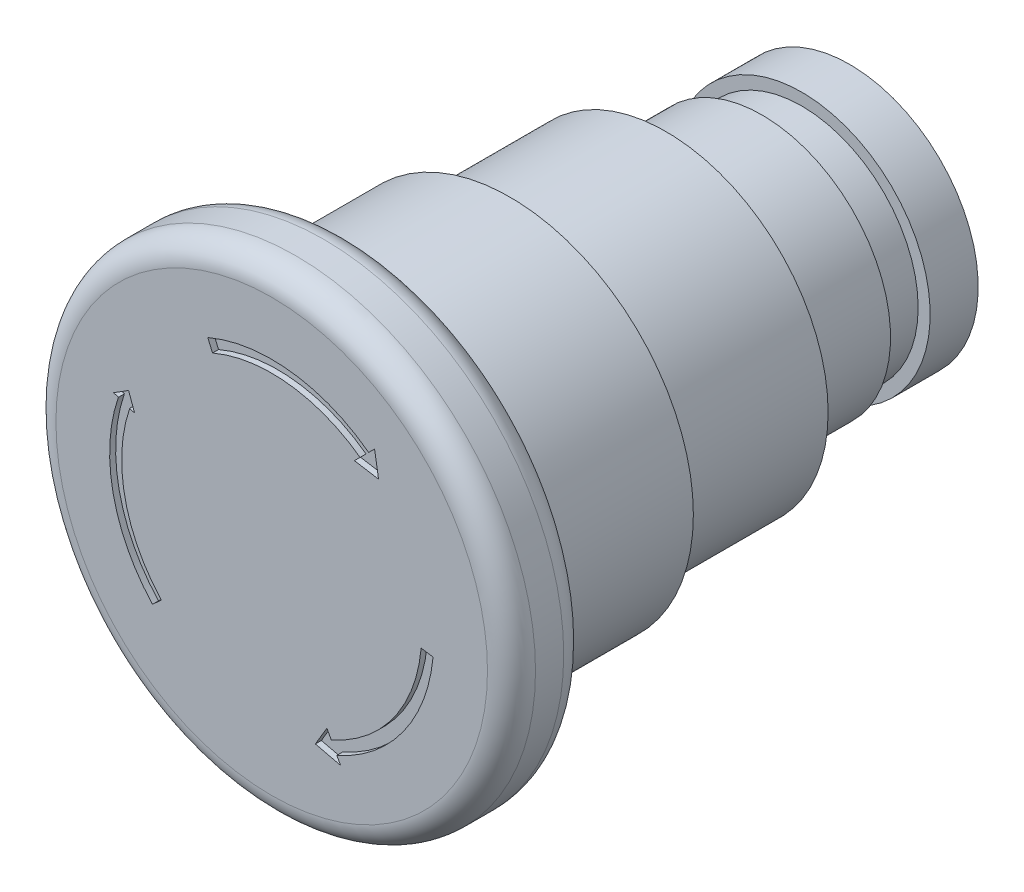
ISO-10303-21;
HEADER;
FILE_DESCRIPTION(('STEP AP214'),'2;1');
FILE_NAME('part.step','',(''),(''),'','','');
FILE_SCHEMA(('AUTOMOTIVE_DESIGN { 1 0 10303 214 1 1 1 1 }'));
ENDSEC;
DATA;
#1=APPLICATION_CONTEXT('core data for automotive mechanical design processes');
#2=APPLICATION_PROTOCOL_DEFINITION('international standard','automotive_design',2000,#1);
#3=PRODUCT_CONTEXT('',#1,'mechanical');
#4=PRODUCT('Part','Part','',(#3));
#5=PRODUCT_RELATED_PRODUCT_CATEGORY('part','',(#4));
#6=PRODUCT_DEFINITION_FORMATION('','',#4);
#7=PRODUCT_DEFINITION_CONTEXT('part definition',#1,'design');
#8=PRODUCT_DEFINITION('design','',#6,#7);
#9=PRODUCT_DEFINITION_SHAPE('','',#8);
#10=(LENGTH_UNIT() NAMED_UNIT(*) SI_UNIT(.MILLI.,.METRE.));
#11=(NAMED_UNIT(*) PLANE_ANGLE_UNIT() SI_UNIT($,.RADIAN.));
#12=(NAMED_UNIT(*) SI_UNIT($,.STERADIAN.) SOLID_ANGLE_UNIT());
#13=UNCERTAINTY_MEASURE_WITH_UNIT(LENGTH_MEASURE(1.E-05),#10,'distance_accuracy_value','');
#14=(GEOMETRIC_REPRESENTATION_CONTEXT(3) GLOBAL_UNCERTAINTY_ASSIGNED_CONTEXT((#13)) GLOBAL_UNIT_ASSIGNED_CONTEXT((#10,
#11,#12)) REPRESENTATION_CONTEXT('',''));
#15=CARTESIAN_POINT('',(0.,0.,0.));
#16=DIRECTION('',(0.,0.,1.));
#17=DIRECTION('',(1.,0.,0.));
#18=AXIS2_PLACEMENT_3D('',#15,#16,#17);
#19=CARTESIAN_POINT('',(0.,0.,6.35));
#20=DIRECTION('',(0.,0.,1.));
#21=DIRECTION('',(1.,0.,0.));
#22=AXIS2_PLACEMENT_3D('',#19,#20,#21);
#23=PLANE('',#22);
#24=DIRECTION('',(0.946159047702966,-0.3237021106663,0.));
#25=VECTOR('',#24,1.);
#26=CARTESIAN_POINT('',(-11.8269880962871,4.04627638332874,6.35));
#27=LINE('',#26,#25);
#28=CARTESIAN_POINT('',(-11.8269880962871,4.04627638332874,6.35));
#29=VERTEX_POINT('',#28);
#30=CARTESIAN_POINT('',(-11.4166932576351,3.90590536897385,6.35));
#31=VERTEX_POINT('',#30);
#32=EDGE_CURVE('E49',#29,#31,#27,.T.);
#33=ORIENTED_EDGE('',*,*,#32,.F.);
#34=CARTESIAN_POINT('',(0.,0.,6.35));
#35=DIRECTION('',(0.,0.,1.));
#36=DIRECTION('',(1.,0.,0.));
#37=AXIS2_PLACEMENT_3D('',#34,#35,#36);
#38=CIRCLE('',#37,12.5);
#39=CARTESIAN_POINT('',(-9.19520920877159,-8.46747468888584,6.35));
#40=VERTEX_POINT('',#39);
#41=EDGE_CURVE('E186',#29,#40,#38,.T.);
#42=ORIENTED_EDGE('',*,*,#41,.T.);
#43=DIRECTION('',(0.735616736701727,0.677397975110867,0.));
#44=VECTOR('',#43,1.);
#45=CARTESIAN_POINT('',(-9.93082594547331,-9.14487266399671,6.35));
#46=LINE('',#45,#44);
#47=CARTESIAN_POINT('',(-9.93082594547331,-9.14487266399671,6.35));
#48=VERTEX_POINT('',#47);
#49=EDGE_CURVE('E192',#48,#40,#46,.T.);
#50=ORIENTED_EDGE('',*,*,#49,.F.);
#51=CARTESIAN_POINT('',(0.,0.,6.35));
#52=DIRECTION('',(0.,0.,1.));
#53=DIRECTION('',(1.,0.,0.));
#54=AXIS2_PLACEMENT_3D('',#51,#52,#53);
#55=CIRCLE('',#54,13.5);
#56=CARTESIAN_POINT('',(-12.77314714399,4.36997849399504,6.35));
#57=VERTEX_POINT('',#56);
#58=EDGE_CURVE('E864',#57,#48,#55,.T.);
#59=ORIENTED_EDGE('',*,*,#58,.F.);
#60=DIRECTION('',(0.946159047702967,-0.323702110666296,0.));
#61=VECTOR('',#60,1.);
#62=CARTESIAN_POINT('',(-13.1680559862563,4.50508561586079,6.35));
#63=LINE('',#62,#61);
#64=CARTESIAN_POINT('',(-13.1680559862563,4.50508561586079,6.35));
#65=VERTEX_POINT('',#64);
#66=EDGE_CURVE('E863',#65,#57,#63,.T.);
#67=ORIENTED_EDGE('',*,*,#66,.F.);
#68=DIRECTION('',(-0.847110823370431,-0.531416270854281,0.));
#69=VECTOR('',#68,1.);
#70=CARTESIAN_POINT('',(-11.9225679380885,5.28641504253192,6.35));
#71=LINE('',#70,#69);
#72=CARTESIAN_POINT('',(-11.9225679380885,5.28641504253192,6.35));
#73=VERTEX_POINT('',#72);
#74=EDGE_CURVE('E203',#73,#65,#71,.T.);
#75=ORIENTED_EDGE('',*,*,#74,.F.);
#76=DIRECTION('',(-0.344067466332959,0.938944928422971,0.));
#77=VECTOR('',#76,1.);
#78=CARTESIAN_POINT('',(-11.4166932576351,3.90590536897385,6.35));
#79=LINE('',#78,#77);
#80=EDGE_CURVE('E198',#31,#73,#79,.T.);
#81=ORIENTED_EDGE('',*,*,#80,.F.);
#82=EDGE_LOOP('',(#33,#42,#50,#59,#67,#75,#81));
#83=FACE_BOUND('',#82,.T.);
#84=CARTESIAN_POINT('',(0.,0.,6.35));
#85=DIRECTION('',(0.,0.,1.));
#86=DIRECTION('',(1.,0.,0.));
#87=AXIS2_PLACEMENT_3D('',#84,#85,#86);
#88=CIRCLE('',#87,13.5);
#89=CARTESIAN_POINT('',(8.07680924443977,10.8173542249911,6.35));
#90=VERTEX_POINT('',#89);
#91=CARTESIAN_POINT('',(-5.32427616980022,12.4057278411102,6.35));
#92=VERTEX_POINT('',#91);
#93=EDGE_CURVE('E295',#90,#92,#88,.T.);
#94=ORIENTED_EDGE('',*,*,#93,.F.);
#95=DIRECTION('',(0.707106781186548,0.707106781186548,0.));
#96=VECTOR('',#95,1.);
#97=CARTESIAN_POINT('',(-1.37027249027566,1.37027249027566,6.35));
#98=LINE('',#97,#96);
#99=CARTESIAN_POINT('',(8.56914572080994,11.3096907013613,6.35));
#100=VERTEX_POINT('',#99);
#101=EDGE_CURVE('E258',#90,#100,#98,.T.);
#102=ORIENTED_EDGE('',*,*,#101,.T.);
#103=DIRECTION('',(-0.163195946532775,0.986593676766313,0.));
#104=VECTOR('',#103,1.);
#105=CARTESIAN_POINT('',(10.1618760605068,1.68091182955754,6.35));
#106=LINE('',#105,#104);
#107=CARTESIAN_POINT('',(8.90198472506287,9.29752763019587,6.35));
#108=VERTEX_POINT('',#107);
#109=EDGE_CURVE('E276',#108,#100,#106,.T.);
#110=ORIENTED_EDGE('',*,*,#109,.F.);
#111=DIRECTION('',(0.986593676766313,-0.163195946532772,0.));
#112=VECTOR('',#111,1.);
#113=CARTESIAN_POINT('',(1.73406297545167,10.4831988970488,6.35));
#114=LINE('',#113,#112);
#115=CARTESIAN_POINT('',(6.88982165389748,9.63036663444879,6.35));
#116=VERTEX_POINT('',#115);
#117=EDGE_CURVE('E307',#116,#108,#114,.T.);
#118=ORIENTED_EDGE('',*,*,#117,.F.);
#119=DIRECTION('',(0.707106781186546,0.707106781186549,0.));
#120=VECTOR('',#119,1.);
#121=CARTESIAN_POINT('',(-1.37027249027564,1.37027249027563,6.35));
#122=LINE('',#121,#120);
#123=CARTESIAN_POINT('',(7.36170055723163,10.1022455377829,6.35));
#124=VERTEX_POINT('',#123);
#125=EDGE_CURVE('E304',#116,#124,#122,.T.);
#126=ORIENTED_EDGE('',*,*,#125,.T.);
#127=CARTESIAN_POINT('',(0.,0.,6.35));
#128=DIRECTION('',(0.,0.,1.));
#129=DIRECTION('',(1.,0.,0.));
#130=AXIS2_PLACEMENT_3D('',#127,#128,#129);
#131=CIRCLE('',#130,12.5);
#132=CARTESIAN_POINT('',(-4.92988534240761,11.486785038065,6.35));
#133=VERTEX_POINT('',#132);
#134=EDGE_CURVE('E301',#124,#133,#131,.T.);
#135=ORIENTED_EDGE('',*,*,#134,.T.);
#136=DIRECTION('',(0.394390827392609,-0.918942803045202,0.));
#137=VECTOR('',#136,1.);
#138=CARTESIAN_POINT('',(0.,0.,6.35));
#139=LINE('',#138,#137);
#140=EDGE_CURVE('E298',#92,#133,#139,.T.);
#141=ORIENTED_EDGE('',*,*,#140,.F.);
#142=EDGE_LOOP('',(#94,#102,#110,#118,#126,#135,#141));
#143=FACE_BOUND('',#142,.T.);
#144=CARTESIAN_POINT('',(0.,0.,6.35));
#145=DIRECTION('',(0.,0.,1.));
#146=DIRECTION('',(1.,0.,0.));
#147=AXIS2_PLACEMENT_3D('',#144,#145,#146);
#148=CIRCLE('',#147,17.975);
#149=CARTESIAN_POINT('',(17.975,0.,6.35));
#150=VERTEX_POINT('',#149);
#151=EDGE_CURVE('E11',#150,#150,#148,.T.);
#152=ORIENTED_EDGE('',*,*,#151,.T.);
#153=EDGE_LOOP('',(#152));
#154=FACE_BOUND('',#153,.T.);
#155=CARTESIAN_POINT('',(0.,0.,6.35));
#156=DIRECTION('',(0.,0.,1.));
#157=DIRECTION('',(1.,0.,0.));
#158=AXIS2_PLACEMENT_3D('',#155,#156,#157);
#159=CIRCLE('',#158,13.5);
#160=CARTESIAN_POINT('',(5.42803448979416,-12.3606812748167,6.35));
#161=VERTEX_POINT('',#160);
#162=CARTESIAN_POINT('',(13.4409039520645,-1.2617848276852,6.35));
#163=VERTEX_POINT('',#162);
#164=EDGE_CURVE('E254',#161,#163,#159,.T.);
#165=ORIENTED_EDGE('',*,*,#164,.F.);
#166=DIRECTION('',(0.471282596185607,-0.881982264295918,0.));
#167=VECTOR('',#166,1.);
#168=CARTESIAN_POINT('',(-0.915448033372817,-0.489164854335662,6.35));
#169=LINE('',#168,#167);
#170=CARTESIAN_POINT('',(5.73317722565874,-12.931740938996,6.35));
#171=VERTEX_POINT('',#170);
#172=EDGE_CURVE('E57',#161,#171,#169,.T.);
#173=ORIENTED_EDGE('',*,*,#172,.T.);
#174=DIRECTION('',(-0.97275686117343,0.231827714132753,0.));
#175=VECTOR('',#174,1.);
#176=CARTESIAN_POINT('',(-2.608138369295,-10.943836042694,6.35));
#177=LINE('',#176,#175);
#178=CARTESIAN_POINT('',(3.63822210471963,-12.432470590687,6.35));
#179=VERTEX_POINT('',#178);
#180=EDGE_CURVE('E238',#171,#179,#177,.T.);
#181=ORIENTED_EDGE('',*,*,#180,.T.);
#182=DIRECTION('',(0.510483811169878,0.859887363864289,0.));
#183=VECTOR('',#182,1.);
#184=CARTESIAN_POINT('',(8.14746388692598,-4.83685258226836,6.35));
#185=LINE('',#184,#183);
#186=CARTESIAN_POINT('',(4.60037768062816,-10.8117621496117,6.35));
#187=VERTEX_POINT('',#186);
#188=EDGE_CURVE('E241',#179,#187,#185,.T.);
#189=ORIENTED_EDGE('',*,*,#188,.T.);
#190=DIRECTION('',(0.471282596185608,-0.881982264295917,0.));
#191=VECTOR('',#190,1.);
#192=CARTESIAN_POINT('',(-0.915448033372825,-0.489164854335667,6.35));
#193=LINE('',#192,#191);
#194=CARTESIAN_POINT('',(4.95524026524867,-11.4758700721844,6.35));
#195=VERTEX_POINT('',#194);
#196=EDGE_CURVE('E245',#187,#195,#193,.T.);
#197=ORIENTED_EDGE('',*,*,#196,.T.);
#198=CARTESIAN_POINT('',(0.,0.,6.35));
#199=DIRECTION('',(0.,0.,1.));
#200=DIRECTION('',(1.,0.,0.));
#201=AXIS2_PLACEMENT_3D('',#198,#199,#200);
#202=CIRCLE('',#201,12.5);
#203=CARTESIAN_POINT('',(12.4505351593556,-1.11093395197457,6.35));
#204=VERTEX_POINT('',#203);
#205=EDGE_CURVE('E248',#195,#204,#202,.T.);
#206=ORIENTED_EDGE('',*,*,#205,.T.);
#207=DIRECTION('',(0.988597659409688,-0.150581100439886,0.));
#208=VECTOR('',#207,1.);
#209=CARTESIAN_POINT('',(0.116933539823893,0.767694109278604,6.35));
#210=LINE('',#209,#208);
#211=EDGE_CURVE('E251',#204,#163,#210,.T.);
#212=ORIENTED_EDGE('',*,*,#211,.T.);
#213=EDGE_LOOP('',(#165,#173,#181,#189,#197,#206,#212));
#214=FACE_BOUND('',#213,.T.);
#215=ADVANCED_FACE('F34',(#83,#143,#154,#214),#23,.T.);
#216=CARTESIAN_POINT('',(0.,0.,-26.5));
#217=DIRECTION('',(0.,0.,-1.));
#218=DIRECTION('',(-1.,0.,0.));
#219=AXIS2_PLACEMENT_3D('',#216,#217,#218);
#220=PLANE('',#219);
#221=CARTESIAN_POINT('',(0.,0.,-26.5));
#222=DIRECTION('',(0.,0.,-1.));
#223=DIRECTION('',(-1.,0.,0.));
#224=AXIS2_PLACEMENT_3D('',#221,#222,#223);
#225=CIRCLE('',#224,13.5);
#226=CARTESIAN_POINT('',(-13.5,0.,-26.5));
#227=VERTEX_POINT('',#226);
#228=EDGE_CURVE('E345',#227,#227,#225,.T.);
#229=ORIENTED_EDGE('',*,*,#228,.T.);
#230=EDGE_LOOP('',(#229));
#231=FACE_BOUND('',#230,.T.);
#232=CARTESIAN_POINT('',(0.,0.,-26.5));
#233=DIRECTION('',(0.,0.,-1.));
#234=DIRECTION('',(-1.,0.,0.));
#235=AXIS2_PLACEMENT_3D('',#232,#233,#234);
#236=CIRCLE('',#235,10.7);
#237=CARTESIAN_POINT('',(-10.7,0.,-26.5));
#238=VERTEX_POINT('',#237);
#239=EDGE_CURVE('E338',#238,#238,#236,.T.);
#240=ORIENTED_EDGE('',*,*,#239,.F.);
#241=EDGE_LOOP('',(#240));
#242=FACE_BOUND('',#241,.T.);
#243=ADVANCED_FACE('F385',(#231,#242),#220,.T.);
#244=CARTESIAN_POINT('',(0.,0.,-13.5));
#245=DIRECTION('',(0.,0.,-1.));
#246=DIRECTION('',(-1.,0.,0.));
#247=AXIS2_PLACEMENT_3D('',#244,#245,#246);
#248=PLANE('',#247);
#249=CARTESIAN_POINT('',(0.,0.,-13.5));
#250=DIRECTION('',(0.,0.,-1.));
#251=DIRECTION('',(-1.,0.,0.));
#252=AXIS2_PLACEMENT_3D('',#249,#250,#251);
#253=CIRCLE('',#252,15.275);
#254=CARTESIAN_POINT('',(-15.275,0.,-13.5));
#255=VERTEX_POINT('',#254);
#256=EDGE_CURVE('E348',#255,#255,#253,.T.);
#257=ORIENTED_EDGE('',*,*,#256,.T.);
#258=EDGE_LOOP('',(#257));
#259=FACE_BOUND('',#258,.T.);
#260=CARTESIAN_POINT('',(0.,0.,-13.5));
#261=DIRECTION('',(0.,0.,-1.));
#262=DIRECTION('',(-1.,0.,0.));
#263=AXIS2_PLACEMENT_3D('',#260,#261,#262);
#264=CIRCLE('',#263,13.5);
#265=CARTESIAN_POINT('',(-13.5,0.,-13.5));
#266=VERTEX_POINT('',#265);
#267=EDGE_CURVE('E342',#266,#266,#264,.T.);
#268=ORIENTED_EDGE('',*,*,#267,.F.);
#269=EDGE_LOOP('',(#268));
#270=FACE_BOUND('',#269,.T.);
#271=ADVANCED_FACE('F390',(#259,#270),#248,.T.);
#272=CARTESIAN_POINT('',(0.,0.,0.));
#273=DIRECTION('',(0.,0.,1.));
#274=DIRECTION('',(1.,0.,0.));
#275=AXIS2_PLACEMENT_3D('',#272,#273,#274);
#276=PLANE('',#275);
#277=CARTESIAN_POINT('',(0.,0.,0.));
#278=DIRECTION('',(0.,0.,1.));
#279=DIRECTION('',(1.,0.,0.));
#280=AXIS2_PLACEMENT_3D('',#277,#278,#279);
#281=CIRCLE('',#280,17.275);
#282=CARTESIAN_POINT('',(17.275,0.,0.));
#283=VERTEX_POINT('',#282);
#284=EDGE_CURVE('E359',#283,#283,#281,.T.);
#285=ORIENTED_EDGE('',*,*,#284,.T.);
#286=EDGE_LOOP('',(#285));
#287=FACE_BOUND('',#286,.T.);
#288=CARTESIAN_POINT('',(0.,0.,0.));
#289=DIRECTION('',(0.,0.,1.));
#290=DIRECTION('',(1.,0.,0.));
#291=AXIS2_PLACEMENT_3D('',#288,#289,#290);
#292=CIRCLE('',#291,17.975);
#293=CARTESIAN_POINT('',(17.975,0.,0.));
#294=VERTEX_POINT('',#293);
#295=EDGE_CURVE('E356',#294,#294,#292,.F.);
#296=ORIENTED_EDGE('',*,*,#295,.T.);
#297=EDGE_LOOP('',(#296));
#298=FACE_BOUND('',#297,.T.);
#299=ADVANCED_FACE('F397',(#287,#298),#276,.F.);
#300=CARTESIAN_POINT('',(0.,0.,6.35));
#301=DIRECTION('',(0.,0.,-1.));
#302=DIRECTION('',(-1.,0.,0.));
#303=AXIS2_PLACEMENT_3D('',#300,#301,#302);
#304=CYLINDRICAL_SURFACE('',#303,19.975);
#305=CARTESIAN_POINT('',(0.,0.,2.));
#306=DIRECTION('',(0.,0.,1.));
#307=DIRECTION('',(1.,0.,0.));
#308=AXIS2_PLACEMENT_3D('',#305,#306,#307);
#309=CIRCLE('',#308,19.975);
#310=CARTESIAN_POINT('',(19.975,0.,2.));
#311=VERTEX_POINT('',#310);
#312=EDGE_CURVE('E42',#311,#311,#309,.T.);
#313=ORIENTED_EDGE('',*,*,#312,.T.);
#314=EDGE_LOOP('',(#313));
#315=FACE_BOUND('',#314,.T.);
#316=CARTESIAN_POINT('',(0.,0.,4.35));
#317=DIRECTION('',(0.,0.,1.));
#318=DIRECTION('',(1.,0.,0.));
#319=AXIS2_PLACEMENT_3D('',#316,#317,#318);
#320=CIRCLE('',#319,19.975);
#321=CARTESIAN_POINT('',(19.975,0.,4.35));
#322=VERTEX_POINT('',#321);
#323=EDGE_CURVE('E362',#322,#322,#320,.F.);
#324=ORIENTED_EDGE('',*,*,#323,.T.);
#325=EDGE_LOOP('',(#324));
#326=FACE_BOUND('',#325,.T.);
#327=ADVANCED_FACE('F367',(#315,#326),#304,.T.);
#328=CARTESIAN_POINT('',(0.,0.,-13.5));
#329=DIRECTION('',(0.,0.,1.));
#330=DIRECTION('',(1.,0.,0.));
#331=AXIS2_PLACEMENT_3D('',#328,#329,#330);
#332=CYLINDRICAL_SURFACE('',#331,15.275);
#333=CARTESIAN_POINT('',(0.,0.,-2.));
#334=DIRECTION('',(0.,0.,1.));
#335=DIRECTION('',(1.,0.,0.));
#336=AXIS2_PLACEMENT_3D('',#333,#334,#335);
#337=CIRCLE('',#336,15.275);
#338=CARTESIAN_POINT('',(15.275,0.,-2.));
#339=VERTEX_POINT('',#338);
#340=EDGE_CURVE('E353',#339,#339,#337,.F.);
#341=ORIENTED_EDGE('',*,*,#340,.T.);
#342=EDGE_LOOP('',(#341));
#343=FACE_BOUND('',#342,.T.);
#344=ORIENTED_EDGE('',*,*,#256,.F.);
#345=EDGE_LOOP('',(#344));
#346=FACE_BOUND('',#345,.T.);
#347=ADVANCED_FACE('F395',(#343,#346),#332,.T.);
#348=CARTESIAN_POINT('',(0.,0.,-26.5));
#349=DIRECTION('',(0.,0.,1.));
#350=DIRECTION('',(1.,0.,0.));
#351=AXIS2_PLACEMENT_3D('',#348,#349,#350);
#352=CYLINDRICAL_SURFACE('',#351,13.5);
#353=ORIENTED_EDGE('',*,*,#228,.F.);
#354=EDGE_LOOP('',(#353));
#355=FACE_BOUND('',#354,.T.);
#356=ORIENTED_EDGE('',*,*,#267,.T.);
#357=EDGE_LOOP('',(#356));
#358=FACE_BOUND('',#357,.T.);
#359=ADVANCED_FACE('F405',(#355,#358),#352,.T.);
#360=CARTESIAN_POINT('',(0.,0.,-41.8));
#361=DIRECTION('',(0.,0.,1.));
#362=DIRECTION('',(1.,0.,0.));
#363=AXIS2_PLACEMENT_3D('',#360,#361,#362);
#364=CYLINDRICAL_SURFACE('',#363,10.7);
#365=CARTESIAN_POINT('',(0.,0.,-34.5));
#366=DIRECTION('',(0.,0.,-1.));
#367=DIRECTION('',(-1.,0.,0.));
#368=AXIS2_PLACEMENT_3D('',#365,#366,#367);
#369=CIRCLE('',#368,10.7);
#370=CARTESIAN_POINT('',(-10.7,0.,-34.5));
#371=VERTEX_POINT('',#370);
#372=EDGE_CURVE('E332',#371,#371,#369,.T.);
#373=ORIENTED_EDGE('',*,*,#372,.F.);
#374=EDGE_LOOP('',(#373));
#375=FACE_BOUND('',#374,.T.);
#376=ORIENTED_EDGE('',*,*,#239,.T.);
#377=EDGE_LOOP('',(#376));
#378=FACE_BOUND('',#377,.T.);
#379=ADVANCED_FACE('F380',(#375,#378),#364,.T.);
#380=CARTESIAN_POINT('',(0.,0.,-2.));
#381=DIRECTION('',(0.,0.,1.));
#382=DIRECTION('',(1.,0.,0.));
#383=AXIS2_PLACEMENT_3D('',#380,#381,#382);
#384=TOROIDAL_SURFACE('',#383,17.275,2.);
#385=ORIENTED_EDGE('',*,*,#284,.F.);
#386=EDGE_LOOP('',(#385));
#387=FACE_BOUND('',#386,.T.);
#388=ORIENTED_EDGE('',*,*,#340,.F.);
#389=EDGE_LOOP('',(#388));
#390=FACE_BOUND('',#389,.T.);
#391=ADVANCED_FACE('F372',(#387,#390),#384,.F.);
#392=CARTESIAN_POINT('',(0.,0.,2.));
#393=DIRECTION('',(0.,0.,1.));
#394=DIRECTION('',(1.,0.,0.));
#395=AXIS2_PLACEMENT_3D('',#392,#393,#394);
#396=TOROIDAL_SURFACE('',#395,17.975,2.);
#397=ORIENTED_EDGE('',*,*,#295,.F.);
#398=EDGE_LOOP('',(#397));
#399=FACE_BOUND('',#398,.T.);
#400=ORIENTED_EDGE('',*,*,#312,.F.);
#401=EDGE_LOOP('',(#400));
#402=FACE_BOUND('',#401,.T.);
#403=ADVANCED_FACE('F370',(#399,#402),#396,.T.);
#404=CARTESIAN_POINT('',(0.,0.,4.35));
#405=DIRECTION('',(0.,0.,1.));
#406=DIRECTION('',(1.,0.,0.));
#407=AXIS2_PLACEMENT_3D('',#404,#405,#406);
#408=TOROIDAL_SURFACE('',#407,17.975,2.);
#409=ORIENTED_EDGE('',*,*,#323,.F.);
#410=EDGE_LOOP('',(#409));
#411=FACE_BOUND('',#410,.T.);
#412=ORIENTED_EDGE('',*,*,#151,.F.);
#413=EDGE_LOOP('',(#412));
#414=FACE_BOUND('',#413,.T.);
#415=ADVANCED_FACE('F36',(#411,#414),#408,.T.);
#416=CARTESIAN_POINT('',(0.,9.7,-37.8));
#417=DIRECTION('',(0.,0.,-1.));
#418=DIRECTION('',(-1.,0.,0.));
#419=AXIS2_PLACEMENT_3D('',#416,#417,#418);
#420=PLANE('',#419);
#421=CARTESIAN_POINT('',(0.,0.,-37.8));
#422=DIRECTION('',(0.,0.,-1.));
#423=DIRECTION('',(-1.,0.,0.));
#424=AXIS2_PLACEMENT_3D('',#421,#422,#423);
#425=CIRCLE('',#424,10.7);
#426=CARTESIAN_POINT('',(-10.7,0.,-37.8));
#427=VERTEX_POINT('',#426);
#428=EDGE_CURVE('E335',#427,#427,#425,.T.);
#429=ORIENTED_EDGE('',*,*,#428,.F.);
#430=EDGE_LOOP('',(#429));
#431=FACE_BOUND('',#430,.T.);
#432=CARTESIAN_POINT('',(0.,0.,-37.8));
#433=DIRECTION('',(0.,0.,-1.));
#434=DIRECTION('',(-1.,0.,0.));
#435=AXIS2_PLACEMENT_3D('',#432,#433,#434);
#436=CIRCLE('',#435,9.7);
#437=CARTESIAN_POINT('',(-9.7,0.,-37.8));
#438=VERTEX_POINT('',#437);
#439=EDGE_CURVE('E314',#438,#438,#436,.T.);
#440=ORIENTED_EDGE('',*,*,#439,.T.);
#441=EDGE_LOOP('',(#440));
#442=FACE_BOUND('',#441,.T.);
#443=ADVANCED_FACE('F378',(#431,#442),#420,.F.);
#444=CARTESIAN_POINT('',(0.,10.7,-34.5));
#445=DIRECTION('',(0.,0.,1.));
#446=DIRECTION('',(1.,0.,0.));
#447=AXIS2_PLACEMENT_3D('',#444,#445,#446);
#448=PLANE('',#447);
#449=CARTESIAN_POINT('',(0.,0.,-34.5));
#450=DIRECTION('',(0.,0.,-1.));
#451=DIRECTION('',(-1.,0.,0.));
#452=AXIS2_PLACEMENT_3D('',#449,#450,#451);
#453=CIRCLE('',#452,9.7);
#454=CARTESIAN_POINT('',(-9.7,0.,-34.5));
#455=VERTEX_POINT('',#454);
#456=EDGE_CURVE('E329',#455,#455,#453,.T.);
#457=ORIENTED_EDGE('',*,*,#456,.F.);
#458=EDGE_LOOP('',(#457));
#459=FACE_BOUND('',#458,.T.);
#460=ORIENTED_EDGE('',*,*,#372,.T.);
#461=EDGE_LOOP('',(#460));
#462=FACE_BOUND('',#461,.T.);
#463=ADVANCED_FACE('F434',(#459,#462),#448,.F.);
#464=CARTESIAN_POINT('',(0.,0.,-41.8));
#465=DIRECTION('',(0.,0.,-1.));
#466=DIRECTION('',(-1.,0.,0.));
#467=AXIS2_PLACEMENT_3D('',#464,#465,#466);
#468=CYLINDRICAL_SURFACE('',#467,9.7);
#469=ORIENTED_EDGE('',*,*,#439,.F.);
#470=EDGE_LOOP('',(#469));
#471=FACE_BOUND('',#470,.T.);
#472=ORIENTED_EDGE('',*,*,#456,.T.);
#473=EDGE_LOOP('',(#472));
#474=FACE_BOUND('',#473,.T.);
#475=ADVANCED_FACE('F430',(#471,#474),#468,.T.);
#476=CARTESIAN_POINT('',(0.,0.,-41.8));
#477=DIRECTION('',(0.,0.,-1.));
#478=DIRECTION('',(-1.,0.,0.));
#479=AXIS2_PLACEMENT_3D('',#476,#477,#478);
#480=PLANE('',#479);
#481=CARTESIAN_POINT('',(0.,0.,-41.8));
#482=DIRECTION('',(0.,0.,-1.));
#483=DIRECTION('',(-1.,0.,0.));
#484=AXIS2_PLACEMENT_3D('',#481,#482,#483);
#485=CIRCLE('',#484,10.7);
#486=CARTESIAN_POINT('',(-10.7,0.,-41.8));
#487=VERTEX_POINT('',#486);
#488=EDGE_CURVE('E339',#487,#487,#485,.T.);
#489=ORIENTED_EDGE('',*,*,#488,.T.);
#490=EDGE_LOOP('',(#489));
#491=FACE_BOUND('',#490,.T.);
#492=ADVANCED_FACE('F427',(#491),#480,.T.);
#493=ORIENTED_EDGE('',*,*,#428,.T.);
#494=EDGE_LOOP('',(#493));
#495=FACE_BOUND('',#494,.T.);
#496=ORIENTED_EDGE('',*,*,#488,.F.);
#497=EDGE_LOOP('',(#496));
#498=FACE_BOUND('',#497,.T.);
#499=ADVANCED_FACE('F426',(#495,#498),#364,.T.);
#500=CARTESIAN_POINT('',(-1.37027249027566,1.37027249027566,5.85));
#501=DIRECTION('',(0.707106781186547,-0.707106781186547,0.));
#502=DIRECTION('',(0.707106781186548,0.707106781186548,0.));
#503=AXIS2_PLACEMENT_3D('',#500,#501,#502);
#504=PLANE('',#503);
#505=ORIENTED_EDGE('',*,*,#101,.F.);
#506=DIRECTION('',(0.,0.,1.));
#507=VECTOR('',#506,1.);
#508=CARTESIAN_POINT('',(8.07680924443977,10.8173542249911,5.85));
#509=LINE('',#508,#507);
#510=CARTESIAN_POINT('',(8.07680924443977,10.8173542249911,5.85));
#511=VERTEX_POINT('',#510);
#512=EDGE_CURVE('E292',#511,#90,#509,.T.);
#513=ORIENTED_EDGE('',*,*,#512,.F.);
#514=DIRECTION('',(0.707106781186548,0.707106781186548,0.));
#515=VECTOR('',#514,1.);
#516=CARTESIAN_POINT('',(-1.37027249027566,1.37027249027566,5.85));
#517=LINE('',#516,#515);
#518=CARTESIAN_POINT('',(8.56914572080994,11.3096907013613,5.85));
#519=VERTEX_POINT('',#518);
#520=EDGE_CURVE('E273',#511,#519,#517,.T.);
#521=ORIENTED_EDGE('',*,*,#520,.T.);
#522=DIRECTION('',(0.,0.,1.));
#523=VECTOR('',#522,1.);
#524=CARTESIAN_POINT('',(8.56914572080994,11.3096907013613,5.85));
#525=LINE('',#524,#523);
#526=EDGE_CURVE('E312',#519,#100,#525,.T.);
#527=ORIENTED_EDGE('',*,*,#526,.T.);
#528=EDGE_LOOP('',(#505,#513,#521,#527));
#529=FACE_BOUND('',#528,.T.);
#530=ADVANCED_FACE('F442',(#529),#504,.T.);
#531=CARTESIAN_POINT('',(10.1618760605068,1.68091182955754,5.85));
#532=DIRECTION('',(0.986593676766313,0.163195946532775,0.));
#533=DIRECTION('',(-0.163195946532775,0.986593676766313,0.));
#534=AXIS2_PLACEMENT_3D('',#531,#532,#533);
#535=PLANE('',#534);
#536=ORIENTED_EDGE('',*,*,#109,.T.);
#537=ORIENTED_EDGE('',*,*,#526,.F.);
#538=DIRECTION('',(-0.163195946532775,0.986593676766313,0.));
#539=VECTOR('',#538,1.);
#540=CARTESIAN_POINT('',(10.1618760605068,1.68091182955754,5.85));
#541=LINE('',#540,#539);
#542=CARTESIAN_POINT('',(8.90198472506287,9.29752763019587,5.85));
#543=VERTEX_POINT('',#542);
#544=EDGE_CURVE('E289',#543,#519,#541,.T.);
#545=ORIENTED_EDGE('',*,*,#544,.F.);
#546=DIRECTION('',(0.,0.,1.));
#547=VECTOR('',#546,1.);
#548=CARTESIAN_POINT('',(8.90198472506287,9.29752763019587,5.85));
#549=LINE('',#548,#547);
#550=EDGE_CURVE('E315',#543,#108,#549,.T.);
#551=ORIENTED_EDGE('',*,*,#550,.T.);
#552=EDGE_LOOP('',(#536,#537,#545,#551));
#553=FACE_BOUND('',#552,.T.);
#554=ADVANCED_FACE('F445',(#553),#535,.F.);
#555=CARTESIAN_POINT('',(1.73406297545167,10.4831988970488,5.85));
#556=DIRECTION('',(-0.163195946532772,-0.986593676766313,0.));
#557=DIRECTION('',(0.986593676766313,-0.163195946532772,0.));
#558=AXIS2_PLACEMENT_3D('',#555,#556,#557);
#559=PLANE('',#558);
#560=ORIENTED_EDGE('',*,*,#117,.T.);
#561=ORIENTED_EDGE('',*,*,#550,.F.);
#562=DIRECTION('',(0.986593676766313,-0.163195946532772,0.));
#563=VECTOR('',#562,1.);
#564=CARTESIAN_POINT('',(1.73406297545167,10.4831988970488,5.85));
#565=LINE('',#564,#563);
#566=CARTESIAN_POINT('',(6.88982165389748,9.63036663444879,5.85));
#567=VERTEX_POINT('',#566);
#568=EDGE_CURVE('E286',#567,#543,#565,.T.);
#569=ORIENTED_EDGE('',*,*,#568,.F.);
#570=DIRECTION('',(0.,0.,1.));
#571=VECTOR('',#570,1.);
#572=CARTESIAN_POINT('',(6.88982165389748,9.63036663444879,5.85));
#573=LINE('',#572,#571);
#574=EDGE_CURVE('E317',#567,#116,#573,.T.);
#575=ORIENTED_EDGE('',*,*,#574,.T.);
#576=EDGE_LOOP('',(#560,#561,#569,#575));
#577=FACE_BOUND('',#576,.T.);
#578=ADVANCED_FACE('F463',(#577),#559,.F.);
#579=CARTESIAN_POINT('',(-1.37027249027564,1.37027249027563,5.85));
#580=DIRECTION('',(0.707106781186549,-0.707106781186546,0.));
#581=DIRECTION('',(0.707106781186546,0.707106781186549,0.));
#582=AXIS2_PLACEMENT_3D('',#579,#580,#581);
#583=PLANE('',#582);
#584=ORIENTED_EDGE('',*,*,#125,.F.);
#585=ORIENTED_EDGE('',*,*,#574,.F.);
#586=DIRECTION('',(0.707106781186546,0.707106781186549,0.));
#587=VECTOR('',#586,1.);
#588=CARTESIAN_POINT('',(-1.37027249027564,1.37027249027563,5.85));
#589=LINE('',#588,#587);
#590=CARTESIAN_POINT('',(7.36170055723163,10.1022455377829,5.85));
#591=VERTEX_POINT('',#590);
#592=EDGE_CURVE('E284',#567,#591,#589,.T.);
#593=ORIENTED_EDGE('',*,*,#592,.T.);
#594=DIRECTION('',(0.,0.,1.));
#595=VECTOR('',#594,1.);
#596=CARTESIAN_POINT('',(7.36170055723163,10.1022455377829,5.85));
#597=LINE('',#596,#595);
#598=EDGE_CURVE('E319',#591,#124,#597,.T.);
#599=ORIENTED_EDGE('',*,*,#598,.T.);
#600=EDGE_LOOP('',(#584,#585,#593,#599));
#601=FACE_BOUND('',#600,.T.);
#602=ADVANCED_FACE('F459',(#601),#583,.T.);
#603=CARTESIAN_POINT('',(0.,0.,5.85));
#604=DIRECTION('',(0.,0.,1.));
#605=DIRECTION('',(1.,0.,0.));
#606=AXIS2_PLACEMENT_3D('',#603,#604,#605);
#607=CYLINDRICAL_SURFACE('',#606,12.5);
#608=ORIENTED_EDGE('',*,*,#134,.F.);
#609=ORIENTED_EDGE('',*,*,#598,.F.);
#610=CARTESIAN_POINT('',(0.,0.,5.85));
#611=DIRECTION('',(0.,0.,1.));
#612=DIRECTION('',(1.,0.,0.));
#613=AXIS2_PLACEMENT_3D('',#610,#611,#612);
#614=CIRCLE('',#613,12.5);
#615=CARTESIAN_POINT('',(-4.92988534240761,11.486785038065,5.85));
#616=VERTEX_POINT('',#615);
#617=EDGE_CURVE('E282',#591,#616,#614,.T.);
#618=ORIENTED_EDGE('',*,*,#617,.T.);
#619=DIRECTION('',(0.,0.,1.));
#620=VECTOR('',#619,1.);
#621=CARTESIAN_POINT('',(-4.92988534240761,11.486785038065,5.85));
#622=LINE('',#621,#620);
#623=EDGE_CURVE('E321',#616,#133,#622,.T.);
#624=ORIENTED_EDGE('',*,*,#623,.T.);
#625=EDGE_LOOP('',(#608,#609,#618,#624));
#626=FACE_BOUND('',#625,.T.);
#627=ADVANCED_FACE('F455',(#626),#607,.T.);
#628=CARTESIAN_POINT('',(0.,0.,5.85));
#629=DIRECTION('',(-0.918942803045202,-0.394390827392609,0.));
#630=DIRECTION('',(0.394390827392609,-0.918942803045202,0.));
#631=AXIS2_PLACEMENT_3D('',#628,#629,#630);
#632=PLANE('',#631);
#633=ORIENTED_EDGE('',*,*,#140,.T.);
#634=ORIENTED_EDGE('',*,*,#623,.F.);
#635=DIRECTION('',(0.394390827392609,-0.918942803045202,0.));
#636=VECTOR('',#635,1.);
#637=CARTESIAN_POINT('',(0.,0.,5.85));
#638=LINE('',#637,#636);
#639=CARTESIAN_POINT('',(-5.32427616980022,12.4057278411102,5.85));
#640=VERTEX_POINT('',#639);
#641=EDGE_CURVE('E279',#640,#616,#638,.T.);
#642=ORIENTED_EDGE('',*,*,#641,.F.);
#643=DIRECTION('',(0.,0.,1.));
#644=VECTOR('',#643,1.);
#645=CARTESIAN_POINT('',(-5.32427616980022,12.4057278411102,5.85));
#646=LINE('',#645,#644);
#647=EDGE_CURVE('E323',#640,#92,#646,.T.);
#648=ORIENTED_EDGE('',*,*,#647,.T.);
#649=EDGE_LOOP('',(#633,#634,#642,#648));
#650=FACE_BOUND('',#649,.T.);
#651=ADVANCED_FACE('F451',(#650),#632,.F.);
#652=CARTESIAN_POINT('',(0.,0.,5.85));
#653=DIRECTION('',(0.,0.,1.));
#654=DIRECTION('',(1.,0.,0.));
#655=AXIS2_PLACEMENT_3D('',#652,#653,#654);
#656=CYLINDRICAL_SURFACE('',#655,13.5);
#657=ORIENTED_EDGE('',*,*,#93,.T.);
#658=ORIENTED_EDGE('',*,*,#647,.F.);
#659=CARTESIAN_POINT('',(0.,0.,5.85));
#660=DIRECTION('',(0.,0.,1.));
#661=DIRECTION('',(1.,0.,0.));
#662=AXIS2_PLACEMENT_3D('',#659,#660,#661);
#663=CIRCLE('',#662,13.5);
#664=EDGE_CURVE('E275',#511,#640,#663,.T.);
#665=ORIENTED_EDGE('',*,*,#664,.F.);
#666=ORIENTED_EDGE('',*,*,#512,.T.);
#667=EDGE_LOOP('',(#657,#658,#665,#666));
#668=FACE_BOUND('',#667,.T.);
#669=ADVANCED_FACE('F447',(#668),#656,.F.);
#670=CARTESIAN_POINT('',(0.,0.,5.85));
#671=DIRECTION('',(0.,0.,1.));
#672=DIRECTION('',(1.,0.,0.));
#673=AXIS2_PLACEMENT_3D('',#670,#671,#672);
#674=PLANE('',#673);
#675=ORIENTED_EDGE('',*,*,#520,.F.);
#676=ORIENTED_EDGE('',*,*,#664,.T.);
#677=ORIENTED_EDGE('',*,*,#641,.T.);
#678=ORIENTED_EDGE('',*,*,#617,.F.);
#679=ORIENTED_EDGE('',*,*,#592,.F.);
#680=ORIENTED_EDGE('',*,*,#568,.T.);
#681=ORIENTED_EDGE('',*,*,#544,.T.);
#682=EDGE_LOOP('',(#675,#676,#677,#678,#679,#680,#681));
#683=FACE_BOUND('',#682,.T.);
#684=ADVANCED_FACE('F450',(#683),#674,.T.);
#685=CARTESIAN_POINT('',(-0.915448033372817,-0.489164854335662,5.85));
#686=DIRECTION('',(-0.881982264295918,-0.471282596185607,0.));
#687=DIRECTION('',(0.471282596185607,-0.881982264295918,0.));
#688=AXIS2_PLACEMENT_3D('',#685,#686,#687);
#689=PLANE('',#688);
#690=ORIENTED_EDGE('',*,*,#172,.F.);
#691=DIRECTION('',(0.,0.,1.));
#692=VECTOR('',#691,1.);
#693=CARTESIAN_POINT('',(5.42803448979416,-12.3606812748167,5.85));
#694=LINE('',#693,#692);
#695=CARTESIAN_POINT('',(5.42803448979416,-12.3606812748167,5.85));
#696=VERTEX_POINT('',#695);
#697=EDGE_CURVE('E226',#696,#161,#694,.T.);
#698=ORIENTED_EDGE('',*,*,#697,.F.);
#699=DIRECTION('',(0.471282596185607,-0.881982264295918,0.));
#700=VECTOR('',#699,1.);
#701=CARTESIAN_POINT('',(-0.915448033372817,-0.489164854335662,5.85));
#702=LINE('',#701,#700);
#703=CARTESIAN_POINT('',(5.73317722565874,-12.931740938996,5.85));
#704=VERTEX_POINT('',#703);
#705=EDGE_CURVE('E242',#696,#704,#702,.T.);
#706=ORIENTED_EDGE('',*,*,#705,.T.);
#707=DIRECTION('',(0.,0.,1.));
#708=VECTOR('',#707,1.);
#709=CARTESIAN_POINT('',(5.73317722565874,-12.931740938996,5.85));
#710=LINE('',#709,#708);
#711=EDGE_CURVE('E199',#704,#171,#710,.T.);
#712=ORIENTED_EDGE('',*,*,#711,.T.);
#713=EDGE_LOOP('',(#690,#698,#706,#712));
#714=FACE_BOUND('',#713,.T.);
#715=ADVANCED_FACE('F473',(#714),#689,.T.);
#716=CARTESIAN_POINT('',(-2.608138369295,-10.943836042694,5.85));
#717=DIRECTION('',(0.231827714132753,0.972756861173429,0.));
#718=DIRECTION('',(-0.97275686117343,0.231827714132753,0.));
#719=AXIS2_PLACEMENT_3D('',#716,#717,#718);
#720=PLANE('',#719);
#721=ORIENTED_EDGE('',*,*,#180,.F.);
#722=ORIENTED_EDGE('',*,*,#711,.F.);
#723=DIRECTION('',(-0.97275686117343,0.231827714132753,0.));
#724=VECTOR('',#723,1.);
#725=CARTESIAN_POINT('',(-2.608138369295,-10.943836042694,5.85));
#726=LINE('',#725,#724);
#727=CARTESIAN_POINT('',(3.63822210471963,-12.432470590687,5.85));
#728=VERTEX_POINT('',#727);
#729=EDGE_CURVE('E228',#704,#728,#726,.T.);
#730=ORIENTED_EDGE('',*,*,#729,.T.);
#731=DIRECTION('',(0.,0.,1.));
#732=VECTOR('',#731,1.);
#733=CARTESIAN_POINT('',(3.63822210471963,-12.432470590687,5.85));
#734=LINE('',#733,#732);
#735=EDGE_CURVE('E201',#728,#179,#734,.T.);
#736=ORIENTED_EDGE('',*,*,#735,.T.);
#737=EDGE_LOOP('',(#721,#722,#730,#736));
#738=FACE_BOUND('',#737,.T.);
#739=ADVANCED_FACE('F480',(#738),#720,.T.);
#740=CARTESIAN_POINT('',(8.14746388692598,-4.83685258226836,5.85));
#741=DIRECTION('',(0.859887363864289,-0.510483811169878,0.));
#742=DIRECTION('',(0.510483811169878,0.859887363864289,0.));
#743=AXIS2_PLACEMENT_3D('',#740,#741,#742);
#744=PLANE('',#743);
#745=ORIENTED_EDGE('',*,*,#188,.F.);
#746=ORIENTED_EDGE('',*,*,#735,.F.);
#747=DIRECTION('',(0.510483811169878,0.859887363864289,0.));
#748=VECTOR('',#747,1.);
#749=CARTESIAN_POINT('',(8.14746388692598,-4.83685258226836,5.85));
#750=LINE('',#749,#748);
#751=CARTESIAN_POINT('',(4.60037768062816,-10.8117621496117,5.85));
#752=VERTEX_POINT('',#751);
#753=EDGE_CURVE('E260',#728,#752,#750,.T.);
#754=ORIENTED_EDGE('',*,*,#753,.T.);
#755=DIRECTION('',(0.,0.,1.));
#756=VECTOR('',#755,1.);
#757=CARTESIAN_POINT('',(4.60037768062816,-10.8117621496117,5.85));
#758=LINE('',#757,#756);
#759=EDGE_CURVE('E235',#752,#187,#758,.T.);
#760=ORIENTED_EDGE('',*,*,#759,.T.);
#761=EDGE_LOOP('',(#745,#746,#754,#760));
#762=FACE_BOUND('',#761,.T.);
#763=ADVANCED_FACE('F483',(#762),#744,.T.);
#764=CARTESIAN_POINT('',(-0.915448033372825,-0.489164854335667,5.85));
#765=DIRECTION('',(-0.881982264295917,-0.471282596185608,0.));
#766=DIRECTION('',(0.471282596185608,-0.881982264295917,0.));
#767=AXIS2_PLACEMENT_3D('',#764,#765,#766);
#768=PLANE('',#767);
#769=ORIENTED_EDGE('',*,*,#196,.F.);
#770=ORIENTED_EDGE('',*,*,#759,.F.);
#771=DIRECTION('',(0.471282596185608,-0.881982264295917,0.));
#772=VECTOR('',#771,1.);
#773=CARTESIAN_POINT('',(-0.915448033372825,-0.489164854335667,5.85));
#774=LINE('',#773,#772);
#775=CARTESIAN_POINT('',(4.95524026524867,-11.4758700721844,5.85));
#776=VERTEX_POINT('',#775);
#777=EDGE_CURVE('E262',#752,#776,#774,.T.);
#778=ORIENTED_EDGE('',*,*,#777,.T.);
#779=DIRECTION('',(0.,0.,1.));
#780=VECTOR('',#779,1.);
#781=CARTESIAN_POINT('',(4.95524026524867,-11.4758700721844,5.85));
#782=LINE('',#781,#780);
#783=EDGE_CURVE('E233',#776,#195,#782,.T.);
#784=ORIENTED_EDGE('',*,*,#783,.T.);
#785=EDGE_LOOP('',(#769,#770,#778,#784));
#786=FACE_BOUND('',#785,.T.);
#787=ADVANCED_FACE('F487',(#786),#768,.T.);
#788=CARTESIAN_POINT('',(0.,0.,5.85));
#789=DIRECTION('',(0.,0.,1.));
#790=DIRECTION('',(1.,0.,0.));
#791=AXIS2_PLACEMENT_3D('',#788,#789,#790);
#792=CYLINDRICAL_SURFACE('',#791,12.5);
#793=ORIENTED_EDGE('',*,*,#205,.F.);
#794=ORIENTED_EDGE('',*,*,#783,.F.);
#795=CARTESIAN_POINT('',(0.,0.,5.85));
#796=DIRECTION('',(0.,0.,1.));
#797=DIRECTION('',(1.,0.,0.));
#798=AXIS2_PLACEMENT_3D('',#795,#796,#797);
#799=CIRCLE('',#798,12.5);
#800=CARTESIAN_POINT('',(12.4505351593556,-1.11093395197457,5.85));
#801=VERTEX_POINT('',#800);
#802=EDGE_CURVE('E264',#776,#801,#799,.T.);
#803=ORIENTED_EDGE('',*,*,#802,.T.);
#804=DIRECTION('',(0.,0.,1.));
#805=VECTOR('',#804,1.);
#806=CARTESIAN_POINT('',(12.4505351593556,-1.11093395197457,5.85));
#807=LINE('',#806,#805);
#808=EDGE_CURVE('E231',#801,#204,#807,.T.);
#809=ORIENTED_EDGE('',*,*,#808,.T.);
#810=EDGE_LOOP('',(#793,#794,#803,#809));
#811=FACE_BOUND('',#810,.T.);
#812=ADVANCED_FACE('F491',(#811),#792,.T.);
#813=CARTESIAN_POINT('',(0.116933539823893,0.767694109278604,5.85));
#814=DIRECTION('',(-0.150581100439886,-0.988597659409688,0.));
#815=DIRECTION('',(0.988597659409688,-0.150581100439886,0.));
#816=AXIS2_PLACEMENT_3D('',#813,#814,#815);
#817=PLANE('',#816);
#818=ORIENTED_EDGE('',*,*,#211,.F.);
#819=ORIENTED_EDGE('',*,*,#808,.F.);
#820=DIRECTION('',(0.988597659409688,-0.150581100439886,0.));
#821=VECTOR('',#820,1.);
#822=CARTESIAN_POINT('',(0.116933539823893,0.767694109278604,5.85));
#823=LINE('',#822,#821);
#824=CARTESIAN_POINT('',(13.4409039520645,-1.2617848276852,5.85));
#825=VERTEX_POINT('',#824);
#826=EDGE_CURVE('E266',#801,#825,#823,.T.);
#827=ORIENTED_EDGE('',*,*,#826,.T.);
#828=DIRECTION('',(0.,0.,1.));
#829=VECTOR('',#828,1.);
#830=CARTESIAN_POINT('',(13.4409039520645,-1.2617848276852,5.85));
#831=LINE('',#830,#829);
#832=EDGE_CURVE('E229',#825,#163,#831,.T.);
#833=ORIENTED_EDGE('',*,*,#832,.T.);
#834=EDGE_LOOP('',(#818,#819,#827,#833));
#835=FACE_BOUND('',#834,.T.);
#836=ADVANCED_FACE('F495',(#835),#817,.T.);
#837=CARTESIAN_POINT('',(0.,0.,5.85));
#838=DIRECTION('',(0.,0.,1.));
#839=DIRECTION('',(1.,0.,0.));
#840=AXIS2_PLACEMENT_3D('',#837,#838,#839);
#841=CYLINDRICAL_SURFACE('',#840,13.5);
#842=ORIENTED_EDGE('',*,*,#164,.T.);
#843=ORIENTED_EDGE('',*,*,#832,.F.);
#844=CARTESIAN_POINT('',(0.,0.,5.85));
#845=DIRECTION('',(0.,0.,1.));
#846=DIRECTION('',(1.,0.,0.));
#847=AXIS2_PLACEMENT_3D('',#844,#845,#846);
#848=CIRCLE('',#847,13.5);
#849=EDGE_CURVE('E268',#696,#825,#848,.T.);
#850=ORIENTED_EDGE('',*,*,#849,.F.);
#851=ORIENTED_EDGE('',*,*,#697,.T.);
#852=EDGE_LOOP('',(#842,#843,#850,#851));
#853=FACE_BOUND('',#852,.T.);
#854=ADVANCED_FACE('F478',(#853),#841,.F.);
#855=CARTESIAN_POINT('',(0.,0.,5.85));
#856=DIRECTION('',(0.,0.,1.));
#857=DIRECTION('',(1.,0.,0.));
#858=AXIS2_PLACEMENT_3D('',#855,#856,#857);
#859=PLANE('',#858);
#860=ORIENTED_EDGE('',*,*,#705,.F.);
#861=ORIENTED_EDGE('',*,*,#849,.T.);
#862=ORIENTED_EDGE('',*,*,#826,.F.);
#863=ORIENTED_EDGE('',*,*,#802,.F.);
#864=ORIENTED_EDGE('',*,*,#777,.F.);
#865=ORIENTED_EDGE('',*,*,#753,.F.);
#866=ORIENTED_EDGE('',*,*,#729,.F.);
#867=EDGE_LOOP('',(#860,#861,#862,#863,#864,#865,#866));
#868=FACE_BOUND('',#867,.T.);
#869=ADVANCED_FACE('F475',(#868),#859,.T.);
#870=CARTESIAN_POINT('',(-11.8269880962871,4.04627638332874,5.85));
#871=DIRECTION('',(-0.3237021106663,-0.946159047702966,0.));
#872=DIRECTION('',(0.946159047702966,-0.3237021106663,0.));
#873=AXIS2_PLACEMENT_3D('',#870,#871,#872);
#874=PLANE('',#873);
#875=ORIENTED_EDGE('',*,*,#32,.T.);
#876=DIRECTION('',(0.,0.,1.));
#877=VECTOR('',#876,1.);
#878=CARTESIAN_POINT('',(-11.4166932576351,3.90590536897385,5.85));
#879=LINE('',#878,#877);
#880=CARTESIAN_POINT('',(-11.4166932576351,3.90590536897385,5.85));
#881=VERTEX_POINT('',#880);
#882=EDGE_CURVE('E210',#881,#31,#879,.T.);
#883=ORIENTED_EDGE('',*,*,#882,.F.);
#884=DIRECTION('',(0.946159047702966,-0.3237021106663,0.));
#885=VECTOR('',#884,1.);
#886=CARTESIAN_POINT('',(-11.8269880962871,4.04627638332874,5.85));
#887=LINE('',#886,#885);
#888=CARTESIAN_POINT('',(-11.8269880962871,4.04627638332874,5.85));
#889=VERTEX_POINT('',#888);
#890=EDGE_CURVE('E180',#889,#881,#887,.T.);
#891=ORIENTED_EDGE('',*,*,#890,.F.);
#892=DIRECTION('',(0.,0.,1.));
#893=VECTOR('',#892,1.);
#894=CARTESIAN_POINT('',(-11.8269880962871,4.04627638332874,5.85));
#895=LINE('',#894,#893);
#896=EDGE_CURVE('E176',#889,#29,#895,.T.);
#897=ORIENTED_EDGE('',*,*,#896,.T.);
#898=EDGE_LOOP('',(#875,#883,#891,#897));
#899=FACE_BOUND('',#898,.T.);
#900=ADVANCED_FACE('F178',(#899),#874,.F.);
#901=CARTESIAN_POINT('',(0.,0.,5.85));
#902=DIRECTION('',(0.,0.,1.));
#903=DIRECTION('',(1.,0.,0.));
#904=AXIS2_PLACEMENT_3D('',#901,#902,#903);
#905=CYLINDRICAL_SURFACE('',#904,12.5);
#906=ORIENTED_EDGE('',*,*,#41,.F.);
#907=ORIENTED_EDGE('',*,*,#896,.F.);
#908=CARTESIAN_POINT('',(0.,0.,5.85));
#909=DIRECTION('',(0.,0.,1.));
#910=DIRECTION('',(1.,0.,0.));
#911=AXIS2_PLACEMENT_3D('',#908,#909,#910);
#912=CIRCLE('',#911,12.5);
#913=CARTESIAN_POINT('',(-9.19520920877159,-8.46747468888584,5.85));
#914=VERTEX_POINT('',#913);
#915=EDGE_CURVE('E207',#889,#914,#912,.T.);
#916=ORIENTED_EDGE('',*,*,#915,.T.);
#917=DIRECTION('',(0.,0.,1.));
#918=VECTOR('',#917,1.);
#919=CARTESIAN_POINT('',(-9.19520920877159,-8.46747468888584,5.85));
#920=LINE('',#919,#918);
#921=EDGE_CURVE('E183',#914,#40,#920,.T.);
#922=ORIENTED_EDGE('',*,*,#921,.T.);
#923=EDGE_LOOP('',(#906,#907,#916,#922));
#924=FACE_BOUND('',#923,.T.);
#925=ADVANCED_FACE('F187',(#924),#905,.T.);
#926=CARTESIAN_POINT('',(-9.93082594547331,-9.14487266399671,5.85));
#927=DIRECTION('',(0.677397975110867,-0.735616736701727,0.));
#928=DIRECTION('',(0.735616736701727,0.677397975110867,0.));
#929=AXIS2_PLACEMENT_3D('',#926,#927,#928);
#930=PLANE('',#929);
#931=ORIENTED_EDGE('',*,*,#49,.T.);
#932=ORIENTED_EDGE('',*,*,#921,.F.);
#933=DIRECTION('',(0.735616736701727,0.677397975110867,0.));
#934=VECTOR('',#933,1.);
#935=CARTESIAN_POINT('',(-9.93082594547331,-9.14487266399671,5.85));
#936=LINE('',#935,#934);
#937=CARTESIAN_POINT('',(-9.93082594547331,-9.14487266399671,5.85));
#938=VERTEX_POINT('',#937);
#939=EDGE_CURVE('E209',#938,#914,#936,.T.);
#940=ORIENTED_EDGE('',*,*,#939,.F.);
#941=DIRECTION('',(0.,0.,1.));
#942=VECTOR('',#941,1.);
#943=CARTESIAN_POINT('',(-9.93082594547331,-9.14487266399671,5.85));
#944=LINE('',#943,#942);
#945=EDGE_CURVE('E871',#938,#48,#944,.T.);
#946=ORIENTED_EDGE('',*,*,#945,.T.);
#947=EDGE_LOOP('',(#931,#932,#940,#946));
#948=FACE_BOUND('',#947,.T.);
#949=ADVANCED_FACE('F512',(#948),#930,.F.);
#950=CARTESIAN_POINT('',(0.,0.,5.85));
#951=DIRECTION('',(0.,0.,1.));
#952=DIRECTION('',(1.,0.,0.));
#953=AXIS2_PLACEMENT_3D('',#950,#951,#952);
#954=CYLINDRICAL_SURFACE('',#953,13.5);
#955=ORIENTED_EDGE('',*,*,#58,.T.);
#956=ORIENTED_EDGE('',*,*,#945,.F.);
#957=CARTESIAN_POINT('',(0.,0.,5.85));
#958=DIRECTION('',(0.,0.,1.));
#959=DIRECTION('',(1.,0.,0.));
#960=AXIS2_PLACEMENT_3D('',#957,#958,#959);
#961=CIRCLE('',#960,13.5);
#962=CARTESIAN_POINT('',(-12.77314714399,4.36997849399504,5.85));
#963=VERTEX_POINT('',#962);
#964=EDGE_CURVE('E213',#963,#938,#961,.T.);
#965=ORIENTED_EDGE('',*,*,#964,.F.);
#966=DIRECTION('',(0.,0.,1.));
#967=VECTOR('',#966,1.);
#968=CARTESIAN_POINT('',(-12.77314714399,4.36997849399504,5.85));
#969=LINE('',#968,#967);
#970=EDGE_CURVE('E873',#963,#57,#969,.T.);
#971=ORIENTED_EDGE('',*,*,#970,.T.);
#972=EDGE_LOOP('',(#955,#956,#965,#971));
#973=FACE_BOUND('',#972,.T.);
#974=ADVANCED_FACE('F515',(#973),#954,.F.);
#975=CARTESIAN_POINT('',(-13.1680559862563,4.50508561586079,5.85));
#976=DIRECTION('',(-0.323702110666297,-0.946159047702967,0.));
#977=DIRECTION('',(0.946159047702967,-0.323702110666297,0.));
#978=AXIS2_PLACEMENT_3D('',#975,#976,#977);
#979=PLANE('',#978);
#980=ORIENTED_EDGE('',*,*,#66,.T.);
#981=ORIENTED_EDGE('',*,*,#970,.F.);
#982=DIRECTION('',(0.946159047702967,-0.323702110666296,0.));
#983=VECTOR('',#982,1.);
#984=CARTESIAN_POINT('',(-13.1680559862563,4.50508561586079,5.85));
#985=LINE('',#984,#983);
#986=CARTESIAN_POINT('',(-13.1680559862563,4.50508561586079,5.85));
#987=VERTEX_POINT('',#986);
#988=EDGE_CURVE('E216',#987,#963,#985,.T.);
#989=ORIENTED_EDGE('',*,*,#988,.F.);
#990=DIRECTION('',(0.,0.,1.));
#991=VECTOR('',#990,1.);
#992=CARTESIAN_POINT('',(-13.1680559862563,4.50508561586079,5.85));
#993=LINE('',#992,#991);
#994=EDGE_CURVE('E875',#987,#65,#993,.T.);
#995=ORIENTED_EDGE('',*,*,#994,.T.);
#996=EDGE_LOOP('',(#980,#981,#989,#995));
#997=FACE_BOUND('',#996,.T.);
#998=ADVANCED_FACE('F519',(#997),#979,.F.);
#999=CARTESIAN_POINT('',(-11.9225679380885,5.28641504253192,5.85));
#1000=DIRECTION('',(-0.531416270854281,0.847110823370431,0.));
#1001=DIRECTION('',(-0.847110823370431,-0.531416270854281,0.));
#1002=AXIS2_PLACEMENT_3D('',#999,#1000,#1001);
#1003=PLANE('',#1002);
#1004=ORIENTED_EDGE('',*,*,#74,.T.);
#1005=ORIENTED_EDGE('',*,*,#994,.F.);
#1006=DIRECTION('',(-0.847110823370431,-0.531416270854281,0.));
#1007=VECTOR('',#1006,1.);
#1008=CARTESIAN_POINT('',(-11.9225679380885,5.28641504253192,5.85));
#1009=LINE('',#1008,#1007);
#1010=CARTESIAN_POINT('',(-11.9225679380885,5.28641504253192,5.85));
#1011=VERTEX_POINT('',#1010);
#1012=EDGE_CURVE('E219',#1011,#987,#1009,.T.);
#1013=ORIENTED_EDGE('',*,*,#1012,.F.);
#1014=DIRECTION('',(0.,0.,1.));
#1015=VECTOR('',#1014,1.);
#1016=CARTESIAN_POINT('',(-11.9225679380885,5.28641504253192,5.85));
#1017=LINE('',#1016,#1015);
#1018=EDGE_CURVE('E857',#1011,#73,#1017,.T.);
#1019=ORIENTED_EDGE('',*,*,#1018,.T.);
#1020=EDGE_LOOP('',(#1004,#1005,#1013,#1019));
#1021=FACE_BOUND('',#1020,.T.);
#1022=ADVANCED_FACE('F523',(#1021),#1003,.F.);
#1023=CARTESIAN_POINT('',(-11.4166932576351,3.90590536897385,5.85));
#1024=DIRECTION('',(0.938944928422971,0.344067466332959,0.));
#1025=DIRECTION('',(-0.344067466332959,0.938944928422971,0.));
#1026=AXIS2_PLACEMENT_3D('',#1023,#1024,#1025);
#1027=PLANE('',#1026);
#1028=ORIENTED_EDGE('',*,*,#80,.T.);
#1029=ORIENTED_EDGE('',*,*,#1018,.F.);
#1030=DIRECTION('',(-0.344067466332959,0.938944928422971,0.));
#1031=VECTOR('',#1030,1.);
#1032=CARTESIAN_POINT('',(-11.4166932576351,3.90590536897385,5.85));
#1033=LINE('',#1032,#1031);
#1034=EDGE_CURVE('E222',#881,#1011,#1033,.T.);
#1035=ORIENTED_EDGE('',*,*,#1034,.F.);
#1036=ORIENTED_EDGE('',*,*,#882,.T.);
#1037=EDGE_LOOP('',(#1028,#1029,#1035,#1036));
#1038=FACE_BOUND('',#1037,.T.);
#1039=ADVANCED_FACE('F508',(#1038),#1027,.F.);
#1040=CARTESIAN_POINT('',(0.,0.,5.85));
#1041=DIRECTION('',(0.,0.,1.));
#1042=DIRECTION('',(1.,0.,0.));
#1043=AXIS2_PLACEMENT_3D('',#1040,#1041,#1042);
#1044=PLANE('',#1043);
#1045=ORIENTED_EDGE('',*,*,#890,.T.);
#1046=ORIENTED_EDGE('',*,*,#1034,.T.);
#1047=ORIENTED_EDGE('',*,*,#1012,.T.);
#1048=ORIENTED_EDGE('',*,*,#988,.T.);
#1049=ORIENTED_EDGE('',*,*,#964,.T.);
#1050=ORIENTED_EDGE('',*,*,#939,.T.);
#1051=ORIENTED_EDGE('',*,*,#915,.F.);
#1052=EDGE_LOOP('',(#1045,#1046,#1047,#1048,#1049,#1050,#1051));
#1053=FACE_BOUND('',#1052,.T.);
#1054=ADVANCED_FACE('F505',(#1053),#1044,.T.);
#1055=CLOSED_SHELL('',(#215,#243,#271,#299,#327,#347,#359,#379,#391,#403,#415,#443,#463,#475,
#492,#499,#530,#554,#578,#602,#627,#651,#669,#684,#715,#739,#763,#787,#812,#836,#854,#869,#900,
#925,#949,#974,#998,#1022,#1039,#1054));
#1056=MANIFOLD_SOLID_BREP('B2',#1055);
#1057=ADVANCED_BREP_SHAPE_REPRESENTATION('',(#18,#1056),#14);
#1058=SHAPE_DEFINITION_REPRESENTATION(#9,#1057);
ENDSEC;
END-ISO-10303-21;
